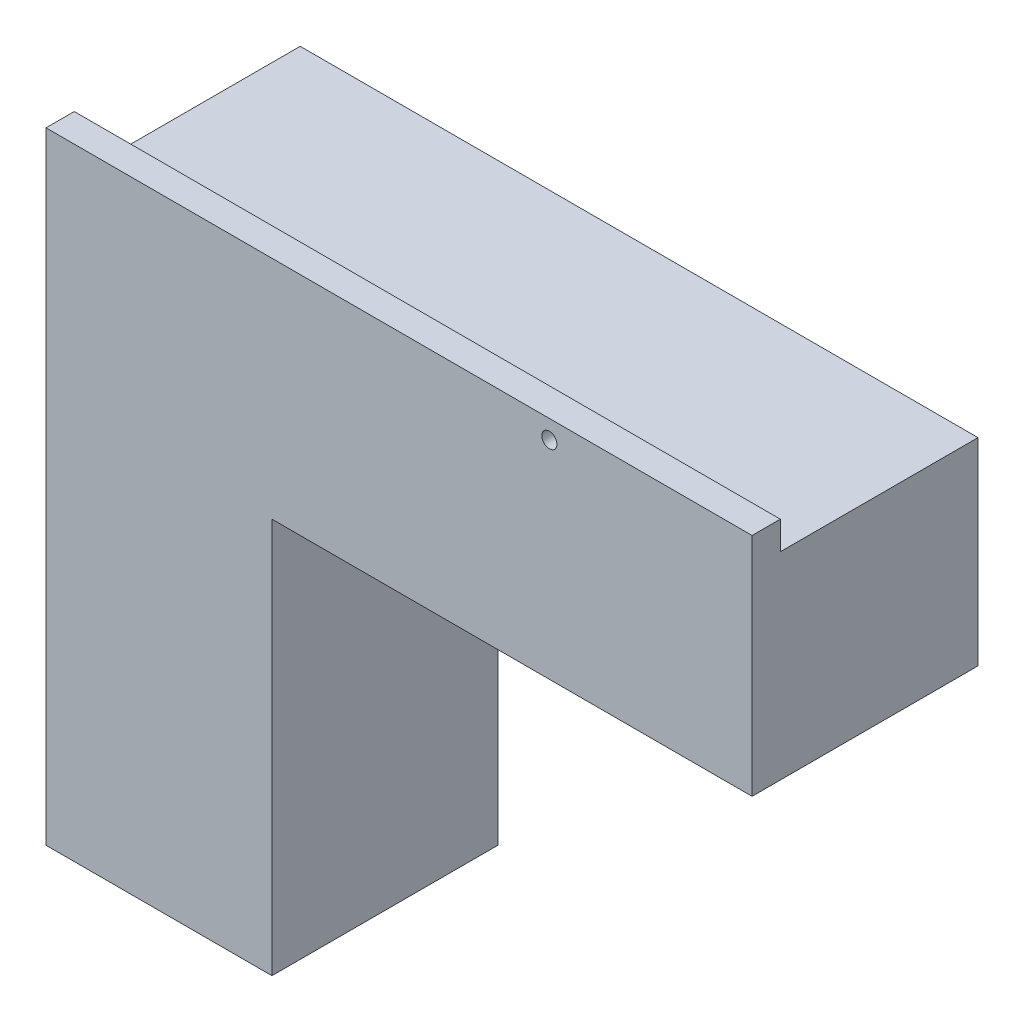
ISO-10303-21;
HEADER;
FILE_DESCRIPTION(('STEP AP214'),'2;1');
FILE_NAME('part.step','',(''),(''),'','','');
FILE_SCHEMA(('AUTOMOTIVE_DESIGN { 1 0 10303 214 1 1 1 1 }'));
ENDSEC;
DATA;
#1=APPLICATION_CONTEXT('core data for automotive mechanical design processes');
#2=APPLICATION_PROTOCOL_DEFINITION('international standard','automotive_design',2000,#1);
#3=PRODUCT_CONTEXT('',#1,'mechanical');
#4=PRODUCT('Part','Part','',(#3));
#5=PRODUCT_RELATED_PRODUCT_CATEGORY('part','',(#4));
#6=PRODUCT_DEFINITION_FORMATION('','',#4);
#7=PRODUCT_DEFINITION_CONTEXT('part definition',#1,'design');
#8=PRODUCT_DEFINITION('design','',#6,#7);
#9=PRODUCT_DEFINITION_SHAPE('','',#8);
#10=(LENGTH_UNIT() NAMED_UNIT(*) SI_UNIT(.MILLI.,.METRE.));
#11=(NAMED_UNIT(*) PLANE_ANGLE_UNIT() SI_UNIT($,.RADIAN.));
#12=(NAMED_UNIT(*) SI_UNIT($,.STERADIAN.) SOLID_ANGLE_UNIT());
#13=UNCERTAINTY_MEASURE_WITH_UNIT(LENGTH_MEASURE(1.E-05),#10,'distance_accuracy_value','');
#14=(GEOMETRIC_REPRESENTATION_CONTEXT(3) GLOBAL_UNCERTAINTY_ASSIGNED_CONTEXT((#13)) GLOBAL_UNIT_ASSIGNED_CONTEXT((#10,
#11,#12)) REPRESENTATION_CONTEXT('',''));
#15=CARTESIAN_POINT('',(0.,0.,0.));
#16=DIRECTION('',(0.,0.,1.));
#17=DIRECTION('',(1.,0.,0.));
#18=AXIS2_PLACEMENT_3D('',#15,#16,#17);
#19=CARTESIAN_POINT('',(80.,0.,80.));
#20=DIRECTION('',(0.,1.,0.));
#21=DIRECTION('',(-1.,0.,0.));
#22=AXIS2_PLACEMENT_3D('',#19,#20,#21);
#23=PLANE('',#22);
#24=DIRECTION('',(0.,0.,-1.));
#25=VECTOR('',#24,1.);
#26=CARTESIAN_POINT('',(0.,0.,80.));
#27=LINE('',#26,#25);
#28=CARTESIAN_POINT('',(0.,0.,80.));
#29=VERTEX_POINT('',#28);
#30=CARTESIAN_POINT('',(0.,0.,70.));
#31=VERTEX_POINT('',#30);
#32=EDGE_CURVE('E118',#29,#31,#27,.T.);
#33=ORIENTED_EDGE('',*,*,#32,.T.);
#34=DIRECTION('',(-1.,0.,0.));
#35=VECTOR('',#34,1.);
#36=CARTESIAN_POINT('',(0.,0.,70.));
#37=LINE('',#36,#35);
#38=CARTESIAN_POINT('',(10.,0.,70.));
#39=VERTEX_POINT('',#38);
#40=EDGE_CURVE('E158',#39,#31,#37,.T.);
#41=ORIENTED_EDGE('',*,*,#40,.F.);
#42=DIRECTION('',(0.,0.,1.));
#43=VECTOR('',#42,1.);
#44=CARTESIAN_POINT('',(10.,0.,0.));
#45=LINE('',#44,#43);
#46=CARTESIAN_POINT('',(10.,0.,0.));
#47=VERTEX_POINT('',#46);
#48=EDGE_CURVE('E147',#47,#39,#45,.T.);
#49=ORIENTED_EDGE('',*,*,#48,.F.);
#50=DIRECTION('',(1.,0.,0.));
#51=VECTOR('',#50,1.);
#52=CARTESIAN_POINT('',(80.,0.,0.));
#53=LINE('',#52,#51);
#54=CARTESIAN_POINT('',(80.,0.,0.));
#55=VERTEX_POINT('',#54);
#56=EDGE_CURVE('E122',#47,#55,#53,.T.);
#57=ORIENTED_EDGE('',*,*,#56,.T.);
#58=DIRECTION('',(0.,0.,-1.));
#59=VECTOR('',#58,1.);
#60=CARTESIAN_POINT('',(80.,0.,80.));
#61=LINE('',#60,#59);
#62=CARTESIAN_POINT('',(80.,0.,80.));
#63=VERTEX_POINT('',#62);
#64=EDGE_CURVE('E137',#63,#55,#61,.T.);
#65=ORIENTED_EDGE('',*,*,#64,.F.);
#66=DIRECTION('',(1.,0.,0.));
#67=VECTOR('',#66,1.);
#68=CARTESIAN_POINT('',(80.,0.,80.));
#69=LINE('',#68,#67);
#70=EDGE_CURVE('E130',#29,#63,#69,.T.);
#71=ORIENTED_EDGE('',*,*,#70,.F.);
#72=EDGE_LOOP('',(#33,#41,#49,#57,#65,#71));
#73=FACE_BOUND('',#72,.T.);
#74=ADVANCED_FACE('F32',(#73),#23,.F.);
#75=CARTESIAN_POINT('',(80.,140.,80.));
#76=DIRECTION('',(-1.,0.,0.));
#77=DIRECTION('',(0.,0.,1.));
#78=AXIS2_PLACEMENT_3D('',#75,#76,#77);
#79=PLANE('',#78);
#80=DIRECTION('',(0.,1.,0.));
#81=VECTOR('',#80,1.);
#82=CARTESIAN_POINT('',(80.,140.,0.));
#83=LINE('',#82,#81);
#84=CARTESIAN_POINT('',(80.,140.,0.));
#85=VERTEX_POINT('',#84);
#86=EDGE_CURVE('E124',#55,#85,#83,.T.);
#87=ORIENTED_EDGE('',*,*,#86,.T.);
#88=DIRECTION('',(0.,0.,-1.));
#89=VECTOR('',#88,1.);
#90=CARTESIAN_POINT('',(80.,140.,80.));
#91=LINE('',#90,#89);
#92=CARTESIAN_POINT('',(80.,140.,80.));
#93=VERTEX_POINT('',#92);
#94=EDGE_CURVE('E135',#93,#85,#91,.T.);
#95=ORIENTED_EDGE('',*,*,#94,.F.);
#96=DIRECTION('',(0.,1.,0.));
#97=VECTOR('',#96,1.);
#98=CARTESIAN_POINT('',(80.,140.,80.));
#99=LINE('',#98,#97);
#100=EDGE_CURVE('E83',#63,#93,#99,.T.);
#101=ORIENTED_EDGE('',*,*,#100,.F.);
#102=ORIENTED_EDGE('',*,*,#64,.T.);
#103=EDGE_LOOP('',(#87,#95,#101,#102));
#104=FACE_BOUND('',#103,.T.);
#105=ADVANCED_FACE('F163',(#104),#79,.F.);
#106=CARTESIAN_POINT('',(250.,140.,80.));
#107=DIRECTION('',(0.,1.,0.));
#108=DIRECTION('',(0.,0.,1.));
#109=AXIS2_PLACEMENT_3D('',#106,#107,#108);
#110=PLANE('',#109);
#111=DIRECTION('',(1.,0.,0.));
#112=VECTOR('',#111,1.);
#113=CARTESIAN_POINT('',(250.,140.,0.));
#114=LINE('',#113,#112);
#115=CARTESIAN_POINT('',(250.,140.,0.));
#116=VERTEX_POINT('',#115);
#117=EDGE_CURVE('E74',#85,#116,#114,.T.);
#118=ORIENTED_EDGE('',*,*,#117,.T.);
#119=DIRECTION('',(0.,0.,-1.));
#120=VECTOR('',#119,1.);
#121=CARTESIAN_POINT('',(250.,140.,80.));
#122=LINE('',#121,#120);
#123=CARTESIAN_POINT('',(250.,140.,80.));
#124=VERTEX_POINT('',#123);
#125=EDGE_CURVE('E112',#124,#116,#122,.T.);
#126=ORIENTED_EDGE('',*,*,#125,.F.);
#127=DIRECTION('',(1.,0.,0.));
#128=VECTOR('',#127,1.);
#129=CARTESIAN_POINT('',(250.,140.,80.));
#130=LINE('',#129,#128);
#131=EDGE_CURVE('E99',#93,#124,#130,.T.);
#132=ORIENTED_EDGE('',*,*,#131,.F.);
#133=ORIENTED_EDGE('',*,*,#94,.T.);
#134=EDGE_LOOP('',(#118,#126,#132,#133));
#135=FACE_BOUND('',#134,.T.);
#136=ADVANCED_FACE('F215',(#135),#110,.F.);
#137=CARTESIAN_POINT('',(250.,220.,80.));
#138=DIRECTION('',(-1.,0.,0.));
#139=DIRECTION('',(0.,0.,1.));
#140=AXIS2_PLACEMENT_3D('',#137,#138,#139);
#141=PLANE('',#140);
#142=DIRECTION('',(0.,1.,0.));
#143=VECTOR('',#142,1.);
#144=CARTESIAN_POINT('',(250.,220.,0.));
#145=LINE('',#144,#143);
#146=CARTESIAN_POINT('',(250.,210.,0.));
#147=VERTEX_POINT('',#146);
#148=EDGE_CURVE('E128',#116,#147,#145,.T.);
#149=ORIENTED_EDGE('',*,*,#148,.T.);
#150=DIRECTION('',(0.,0.,-1.));
#151=VECTOR('',#150,1.);
#152=CARTESIAN_POINT('',(250.,210.,0.));
#153=LINE('',#152,#151);
#154=CARTESIAN_POINT('',(250.,210.,70.));
#155=VERTEX_POINT('',#154);
#156=EDGE_CURVE('E177',#155,#147,#153,.T.);
#157=ORIENTED_EDGE('',*,*,#156,.F.);
#158=DIRECTION('',(0.,-1.,0.));
#159=VECTOR('',#158,1.);
#160=CARTESIAN_POINT('',(250.,220.,70.));
#161=LINE('',#160,#159);
#162=CARTESIAN_POINT('',(250.,220.,70.));
#163=VERTEX_POINT('',#162);
#164=EDGE_CURVE('E109',#163,#155,#161,.T.);
#165=ORIENTED_EDGE('',*,*,#164,.F.);
#166=DIRECTION('',(0.,0.,-1.));
#167=VECTOR('',#166,1.);
#168=CARTESIAN_POINT('',(250.,220.,80.));
#169=LINE('',#168,#167);
#170=CARTESIAN_POINT('',(250.,220.,80.));
#171=VERTEX_POINT('',#170);
#172=EDGE_CURVE('E104',#171,#163,#169,.T.);
#173=ORIENTED_EDGE('',*,*,#172,.F.);
#174=DIRECTION('',(0.,1.,0.));
#175=VECTOR('',#174,1.);
#176=CARTESIAN_POINT('',(250.,220.,80.));
#177=LINE('',#176,#175);
#178=EDGE_CURVE('E92',#124,#171,#177,.T.);
#179=ORIENTED_EDGE('',*,*,#178,.F.);
#180=ORIENTED_EDGE('',*,*,#125,.T.);
#181=EDGE_LOOP('',(#149,#157,#165,#173,#179,#180));
#182=FACE_BOUND('',#181,.T.);
#183=ADVANCED_FACE('F106',(#182),#141,.F.);
#184=CARTESIAN_POINT('',(0.,220.,80.));
#185=DIRECTION('',(0.,-1.,0.));
#186=DIRECTION('',(0.,0.,-1.));
#187=AXIS2_PLACEMENT_3D('',#184,#185,#186);
#188=PLANE('',#187);
#189=ORIENTED_EDGE('',*,*,#172,.T.);
#190=DIRECTION('',(-1.,0.,0.));
#191=VECTOR('',#190,1.);
#192=CARTESIAN_POINT('',(0.,220.,70.));
#193=LINE('',#192,#191);
#194=CARTESIAN_POINT('',(0.,220.,70.));
#195=VERTEX_POINT('',#194);
#196=EDGE_CURVE('E125',#163,#195,#193,.T.);
#197=ORIENTED_EDGE('',*,*,#196,.T.);
#198=DIRECTION('',(0.,0.,-1.));
#199=VECTOR('',#198,1.);
#200=CARTESIAN_POINT('',(0.,220.,80.));
#201=LINE('',#200,#199);
#202=CARTESIAN_POINT('',(0.,220.,80.));
#203=VERTEX_POINT('',#202);
#204=EDGE_CURVE('E113',#203,#195,#201,.T.);
#205=ORIENTED_EDGE('',*,*,#204,.F.);
#206=DIRECTION('',(-1.,0.,0.));
#207=VECTOR('',#206,1.);
#208=CARTESIAN_POINT('',(0.,220.,80.));
#209=LINE('',#208,#207);
#210=EDGE_CURVE('E96',#171,#203,#209,.T.);
#211=ORIENTED_EDGE('',*,*,#210,.F.);
#212=EDGE_LOOP('',(#189,#197,#205,#211));
#213=FACE_BOUND('',#212,.T.);
#214=ADVANCED_FACE('F115',(#213),#188,.F.);
#215=CARTESIAN_POINT('',(0.,0.,80.));
#216=DIRECTION('',(1.,0.,0.));
#217=DIRECTION('',(0.,0.,-1.));
#218=AXIS2_PLACEMENT_3D('',#215,#216,#217);
#219=PLANE('',#218);
#220=ORIENTED_EDGE('',*,*,#204,.T.);
#221=DIRECTION('',(0.,-1.,0.));
#222=VECTOR('',#221,1.);
#223=CARTESIAN_POINT('',(0.,250.,70.));
#224=LINE('',#223,#222);
#225=EDGE_CURVE('E170',#195,#31,#224,.T.);
#226=ORIENTED_EDGE('',*,*,#225,.T.);
#227=ORIENTED_EDGE('',*,*,#32,.F.);
#228=DIRECTION('',(0.,-1.,0.));
#229=VECTOR('',#228,1.);
#230=CARTESIAN_POINT('',(0.,0.,80.));
#231=LINE('',#230,#229);
#232=EDGE_CURVE('E55',#203,#29,#231,.T.);
#233=ORIENTED_EDGE('',*,*,#232,.F.);
#234=EDGE_LOOP('',(#220,#226,#227,#233));
#235=FACE_BOUND('',#234,.T.);
#236=ADVANCED_FACE('F199',(#235),#219,.F.);
#237=CARTESIAN_POINT('',(0.,0.,80.));
#238=DIRECTION('',(0.,0.,-1.));
#239=DIRECTION('',(-1.,0.,0.));
#240=AXIS2_PLACEMENT_3D('',#237,#238,#239);
#241=PLANE('',#240);
#242=CARTESIAN_POINT('',(178.22144368011,213.383591149803,80.));
#243=DIRECTION('',(0.,0.,1.));
#244=DIRECTION('',(1.,0.,0.));
#245=AXIS2_PLACEMENT_3D('',#242,#243,#244);
#246=CIRCLE('',#245,2.69271099101483);
#247=CARTESIAN_POINT('',(180.914154671124,213.383591149803,80.));
#248=VERTEX_POINT('',#247);
#249=EDGE_CURVE('E183',#248,#248,#246,.T.);
#250=ORIENTED_EDGE('',*,*,#249,.F.);
#251=EDGE_LOOP('',(#250));
#252=FACE_BOUND('',#251,.T.);
#253=ORIENTED_EDGE('',*,*,#70,.T.);
#254=ORIENTED_EDGE('',*,*,#100,.T.);
#255=ORIENTED_EDGE('',*,*,#131,.T.);
#256=ORIENTED_EDGE('',*,*,#178,.T.);
#257=ORIENTED_EDGE('',*,*,#210,.T.);
#258=ORIENTED_EDGE('',*,*,#232,.T.);
#259=EDGE_LOOP('',(#253,#254,#255,#256,#257,#258));
#260=FACE_BOUND('',#259,.T.);
#261=ADVANCED_FACE('F94',(#252,#260),#241,.F.);
#262=CARTESIAN_POINT('',(0.,0.,0.));
#263=DIRECTION('',(0.,0.,-1.));
#264=DIRECTION('',(-1.,0.,0.));
#265=AXIS2_PLACEMENT_3D('',#262,#263,#264);
#266=PLANE('',#265);
#267=DIRECTION('',(1.,0.,0.));
#268=VECTOR('',#267,1.);
#269=CARTESIAN_POINT('',(0.,210.,0.));
#270=LINE('',#269,#268);
#271=CARTESIAN_POINT('',(9.99999999999998,210.,0.));
#272=VERTEX_POINT('',#271);
#273=EDGE_CURVE('E159',#272,#147,#270,.T.);
#274=ORIENTED_EDGE('',*,*,#273,.T.);
#275=ORIENTED_EDGE('',*,*,#148,.F.);
#276=ORIENTED_EDGE('',*,*,#117,.F.);
#277=ORIENTED_EDGE('',*,*,#86,.F.);
#278=ORIENTED_EDGE('',*,*,#56,.F.);
#279=DIRECTION('',(0.,-1.,0.));
#280=VECTOR('',#279,1.);
#281=CARTESIAN_POINT('',(10.,0.,0.));
#282=LINE('',#281,#280);
#283=EDGE_CURVE('E39',#272,#47,#282,.T.);
#284=ORIENTED_EDGE('',*,*,#283,.F.);
#285=EDGE_LOOP('',(#274,#275,#276,#277,#278,#284));
#286=FACE_BOUND('',#285,.T.);
#287=ADVANCED_FACE('F161',(#286),#266,.T.);
#288=CARTESIAN_POINT('',(0.,250.,70.));
#289=DIRECTION('',(0.,0.,1.));
#290=DIRECTION('',(1.,0.,0.));
#291=AXIS2_PLACEMENT_3D('',#288,#289,#290);
#292=PLANE('',#291);
#293=CARTESIAN_POINT('',(178.22144368011,213.383591149803,70.));
#294=DIRECTION('',(0.,0.,1.));
#295=DIRECTION('',(1.,0.,0.));
#296=AXIS2_PLACEMENT_3D('',#293,#294,#295);
#297=CIRCLE('',#296,2.69271099101483);
#298=CARTESIAN_POINT('',(180.914154671124,213.383591149803,70.));
#299=VERTEX_POINT('',#298);
#300=EDGE_CURVE('E182',#299,#299,#297,.T.);
#301=ORIENTED_EDGE('',*,*,#300,.T.);
#302=EDGE_LOOP('',(#301));
#303=FACE_BOUND('',#302,.T.);
#304=ORIENTED_EDGE('',*,*,#40,.T.);
#305=ORIENTED_EDGE('',*,*,#225,.F.);
#306=ORIENTED_EDGE('',*,*,#196,.F.);
#307=ORIENTED_EDGE('',*,*,#164,.T.);
#308=DIRECTION('',(1.,0.,0.));
#309=VECTOR('',#308,1.);
#310=CARTESIAN_POINT('',(0.,210.,70.));
#311=LINE('',#310,#309);
#312=CARTESIAN_POINT('',(9.99999999999998,210.,70.));
#313=VERTEX_POINT('',#312);
#314=EDGE_CURVE('E46',#313,#155,#311,.T.);
#315=ORIENTED_EDGE('',*,*,#314,.F.);
#316=DIRECTION('',(0.,-1.,0.));
#317=VECTOR('',#316,1.);
#318=CARTESIAN_POINT('',(9.99999999999998,250.,70.));
#319=LINE('',#318,#317);
#320=EDGE_CURVE('E171',#313,#39,#319,.T.);
#321=ORIENTED_EDGE('',*,*,#320,.T.);
#322=EDGE_LOOP('',(#304,#305,#306,#307,#315,#321));
#323=FACE_BOUND('',#322,.T.);
#324=ADVANCED_FACE('F189',(#303,#323),#292,.F.);
#325=CARTESIAN_POINT('',(9.99999999999998,250.,0.));
#326=DIRECTION('',(1.,0.,0.));
#327=DIRECTION('',(0.,1.,0.));
#328=AXIS2_PLACEMENT_3D('',#325,#326,#327);
#329=PLANE('',#328);
#330=ORIENTED_EDGE('',*,*,#320,.F.);
#331=DIRECTION('',(0.,0.,-1.));
#332=VECTOR('',#331,1.);
#333=CARTESIAN_POINT('',(9.99999999999998,210.,0.));
#334=LINE('',#333,#332);
#335=EDGE_CURVE('E11',#313,#272,#334,.T.);
#336=ORIENTED_EDGE('',*,*,#335,.T.);
#337=ORIENTED_EDGE('',*,*,#283,.T.);
#338=ORIENTED_EDGE('',*,*,#48,.T.);
#339=EDGE_LOOP('',(#330,#336,#337,#338));
#340=FACE_BOUND('',#339,.T.);
#341=ADVANCED_FACE('F145',(#340),#329,.F.);
#342=CARTESIAN_POINT('',(0.,210.,0.));
#343=DIRECTION('',(0.,-1.,0.));
#344=DIRECTION('',(0.,0.,-1.));
#345=AXIS2_PLACEMENT_3D('',#342,#343,#344);
#346=PLANE('',#345);
#347=ORIENTED_EDGE('',*,*,#314,.T.);
#348=ORIENTED_EDGE('',*,*,#156,.T.);
#349=ORIENTED_EDGE('',*,*,#273,.F.);
#350=ORIENTED_EDGE('',*,*,#335,.F.);
#351=EDGE_LOOP('',(#347,#348,#349,#350));
#352=FACE_BOUND('',#351,.T.);
#353=ADVANCED_FACE('F194',(#352),#346,.F.);
#354=CARTESIAN_POINT('',(178.22144368011,213.383591149803,70.));
#355=DIRECTION('',(0.,0.,1.));
#356=DIRECTION('',(1.,0.,0.));
#357=AXIS2_PLACEMENT_3D('',#354,#355,#356);
#358=CYLINDRICAL_SURFACE('',#357,2.69271099101483);
#359=ORIENTED_EDGE('',*,*,#300,.F.);
#360=EDGE_LOOP('',(#359));
#361=FACE_BOUND('',#360,.T.);
#362=ORIENTED_EDGE('',*,*,#249,.T.);
#363=EDGE_LOOP('',(#362));
#364=FACE_BOUND('',#363,.T.);
#365=ADVANCED_FACE('F191',(#361,#364),#358,.F.);
#366=CLOSED_SHELL('',(#74,#105,#136,#183,#214,#236,#261,#287,#324,#341,#353,#365));
#367=MANIFOLD_SOLID_BREP('B2',#366);
#368=ADVANCED_BREP_SHAPE_REPRESENTATION('',(#18,#367),#14);
#369=SHAPE_DEFINITION_REPRESENTATION(#9,#368);
ENDSEC;
END-ISO-10303-21;
